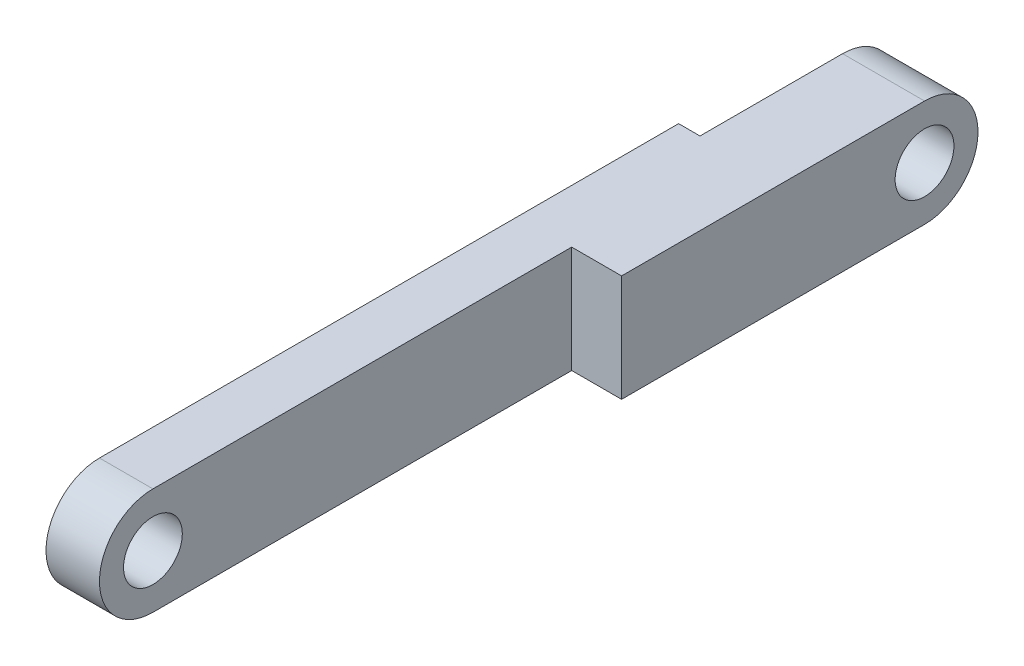
ISO-10303-21;
HEADER;
FILE_DESCRIPTION(('STEP AP214'),'2;1');
FILE_NAME('part.step','',(''),(''),'','','');
FILE_SCHEMA(('AUTOMOTIVE_DESIGN { 1 0 10303 214 1 1 1 1 }'));
ENDSEC;
DATA;
#1=APPLICATION_CONTEXT('core data for automotive mechanical design processes');
#2=APPLICATION_PROTOCOL_DEFINITION('international standard','automotive_design',2000,#1);
#3=PRODUCT_CONTEXT('',#1,'mechanical');
#4=PRODUCT('Part','Part','',(#3));
#5=PRODUCT_RELATED_PRODUCT_CATEGORY('part','',(#4));
#6=PRODUCT_DEFINITION_FORMATION('','',#4);
#7=PRODUCT_DEFINITION_CONTEXT('part definition',#1,'design');
#8=PRODUCT_DEFINITION('design','',#6,#7);
#9=PRODUCT_DEFINITION_SHAPE('','',#8);
#10=(LENGTH_UNIT() NAMED_UNIT(*) SI_UNIT(.MILLI.,.METRE.));
#11=(NAMED_UNIT(*) PLANE_ANGLE_UNIT() SI_UNIT($,.RADIAN.));
#12=(NAMED_UNIT(*) SI_UNIT($,.STERADIAN.) SOLID_ANGLE_UNIT());
#13=UNCERTAINTY_MEASURE_WITH_UNIT(LENGTH_MEASURE(1.E-05),#10,'distance_accuracy_value','');
#14=(GEOMETRIC_REPRESENTATION_CONTEXT(3) GLOBAL_UNCERTAINTY_ASSIGNED_CONTEXT((#13)) GLOBAL_UNIT_ASSIGNED_CONTEXT((#10,
#11,#12)) REPRESENTATION_CONTEXT('',''));
#15=CARTESIAN_POINT('',(0.,0.,0.));
#16=DIRECTION('',(0.,0.,1.));
#17=DIRECTION('',(1.,0.,0.));
#18=AXIS2_PLACEMENT_3D('',#15,#16,#17);
#19=CARTESIAN_POINT('',(3.,0.,0.));
#20=DIRECTION('',(1.,0.,0.));
#21=DIRECTION('',(0.,0.,-1.));
#22=AXIS2_PLACEMENT_3D('',#19,#20,#21);
#23=PLANE('',#22);
#24=DIRECTION('',(0.,-1.,0.));
#25=VECTOR('',#24,1.);
#26=CARTESIAN_POINT('',(3.,0.,-23.5));
#27=LINE('',#26,#25);
#28=CARTESIAN_POINT('',(3.,3.,-23.5));
#29=VERTEX_POINT('',#28);
#30=CARTESIAN_POINT('',(3.,-3.,-23.5));
#31=VERTEX_POINT('',#30);
#32=EDGE_CURVE('E87',#29,#31,#27,.T.);
#33=ORIENTED_EDGE('',*,*,#32,.F.);
#34=DIRECTION('',(0.,0.,1.));
#35=VECTOR('',#34,1.);
#36=CARTESIAN_POINT('',(3.,3.,0.));
#37=LINE('',#36,#35);
#38=CARTESIAN_POINT('',(3.,3.,0.));
#39=VERTEX_POINT('',#38);
#40=EDGE_CURVE('E165',#29,#39,#37,.T.);
#41=ORIENTED_EDGE('',*,*,#40,.T.);
#42=CARTESIAN_POINT('',(3.,0.,0.));
#43=DIRECTION('',(1.,0.,0.));
#44=DIRECTION('',(0.,0.,-1.));
#45=AXIS2_PLACEMENT_3D('',#42,#43,#44);
#46=CIRCLE('',#45,3.);
#47=CARTESIAN_POINT('',(3.,-3.,0.));
#48=VERTEX_POINT('',#47);
#49=EDGE_CURVE('E202',#39,#48,#46,.T.);
#50=ORIENTED_EDGE('',*,*,#49,.T.);
#51=DIRECTION('',(0.,0.,-1.));
#52=VECTOR('',#51,1.);
#53=CARTESIAN_POINT('',(3.,-3.,0.));
#54=LINE('',#53,#52);
#55=EDGE_CURVE('E206',#48,#31,#54,.T.);
#56=ORIENTED_EDGE('',*,*,#55,.T.);
#57=EDGE_LOOP('',(#33,#41,#50,#56));
#58=FACE_BOUND('',#57,.T.);
#59=CARTESIAN_POINT('',(3.,0.,0.));
#60=DIRECTION('',(1.,0.,0.));
#61=DIRECTION('',(0.,0.,-1.));
#62=AXIS2_PLACEMENT_3D('',#59,#60,#61);
#63=CIRCLE('',#62,1.65);
#64=CARTESIAN_POINT('',(3.,0.,-1.65));
#65=VERTEX_POINT('',#64);
#66=EDGE_CURVE('E194',#65,#65,#63,.T.);
#67=ORIENTED_EDGE('',*,*,#66,.F.);
#68=EDGE_LOOP('',(#67));
#69=FACE_BOUND('',#68,.T.);
#70=ADVANCED_FACE('F70',(#58,#69),#23,.T.);
#71=CARTESIAN_POINT('',(0.,0.,0.));
#72=DIRECTION('',(1.,0.,0.));
#73=DIRECTION('',(0.,0.,-1.));
#74=AXIS2_PLACEMENT_3D('',#71,#72,#73);
#75=PLANE('',#74);
#76=DIRECTION('',(0.,0.,1.));
#77=VECTOR('',#76,1.);
#78=CARTESIAN_POINT('',(0.,3.,0.));
#79=LINE('',#78,#77);
#80=CARTESIAN_POINT('',(0.,3.,-32.5));
#81=VERTEX_POINT('',#80);
#82=CARTESIAN_POINT('',(0.,3.,0.));
#83=VERTEX_POINT('',#82);
#84=EDGE_CURVE('E207',#81,#83,#79,.T.);
#85=ORIENTED_EDGE('',*,*,#84,.F.);
#86=DIRECTION('',(0.,1.,0.));
#87=VECTOR('',#86,1.);
#88=CARTESIAN_POINT('',(0.,3.,-32.5));
#89=LINE('',#88,#87);
#90=CARTESIAN_POINT('',(0.,-3.,-32.5));
#91=VERTEX_POINT('',#90);
#92=EDGE_CURVE('E167',#91,#81,#89,.T.);
#93=ORIENTED_EDGE('',*,*,#92,.F.);
#94=DIRECTION('',(0.,0.,-1.));
#95=VECTOR('',#94,1.);
#96=CARTESIAN_POINT('',(0.,-3.,0.));
#97=LINE('',#96,#95);
#98=CARTESIAN_POINT('',(0.,-3.,0.));
#99=VERTEX_POINT('',#98);
#100=EDGE_CURVE('E216',#99,#91,#97,.T.);
#101=ORIENTED_EDGE('',*,*,#100,.F.);
#102=CARTESIAN_POINT('',(0.,0.,0.));
#103=DIRECTION('',(1.,0.,0.));
#104=DIRECTION('',(0.,0.,-1.));
#105=AXIS2_PLACEMENT_3D('',#102,#103,#104);
#106=CIRCLE('',#105,3.);
#107=EDGE_CURVE('E198',#83,#99,#106,.T.);
#108=ORIENTED_EDGE('',*,*,#107,.F.);
#109=EDGE_LOOP('',(#85,#93,#101,#108));
#110=FACE_BOUND('',#109,.T.);
#111=CARTESIAN_POINT('',(0.,0.,0.));
#112=DIRECTION('',(1.,0.,0.));
#113=DIRECTION('',(0.,0.,-1.));
#114=AXIS2_PLACEMENT_3D('',#111,#112,#113);
#115=CIRCLE('',#114,1.65);
#116=CARTESIAN_POINT('',(0.,0.,-1.65));
#117=VERTEX_POINT('',#116);
#118=EDGE_CURVE('E193',#117,#117,#115,.T.);
#119=ORIENTED_EDGE('',*,*,#118,.T.);
#120=EDGE_LOOP('',(#119));
#121=FACE_BOUND('',#120,.T.);
#122=ADVANCED_FACE('F264',(#110,#121),#75,.F.);
#123=CARTESIAN_POINT('',(3.,0.,0.));
#124=DIRECTION('',(-1.,0.,0.));
#125=DIRECTION('',(0.,0.,1.));
#126=AXIS2_PLACEMENT_3D('',#123,#124,#125);
#127=CYLINDRICAL_SURFACE('',#126,3.);
#128=ORIENTED_EDGE('',*,*,#107,.T.);
#129=DIRECTION('',(-1.,0.,0.));
#130=VECTOR('',#129,1.);
#131=CARTESIAN_POINT('',(3.,-3.,0.));
#132=LINE('',#131,#130);
#133=EDGE_CURVE('E12',#48,#99,#132,.T.);
#134=ORIENTED_EDGE('',*,*,#133,.F.);
#135=ORIENTED_EDGE('',*,*,#49,.F.);
#136=DIRECTION('',(-1.,0.,0.));
#137=VECTOR('',#136,1.);
#138=CARTESIAN_POINT('',(3.,3.,0.));
#139=LINE('',#138,#137);
#140=EDGE_CURVE('E212',#39,#83,#139,.T.);
#141=ORIENTED_EDGE('',*,*,#140,.T.);
#142=EDGE_LOOP('',(#128,#134,#135,#141));
#143=FACE_BOUND('',#142,.T.);
#144=ADVANCED_FACE('F72',(#143),#127,.T.);
#145=CARTESIAN_POINT('',(3.,-3.,0.));
#146=DIRECTION('',(0.,1.,0.));
#147=DIRECTION('',(0.,0.,1.));
#148=AXIS2_PLACEMENT_3D('',#145,#146,#147);
#149=PLANE('',#148);
#150=ORIENTED_EDGE('',*,*,#100,.T.);
#151=DIRECTION('',(-1.,0.,0.));
#152=VECTOR('',#151,1.);
#153=CARTESIAN_POINT('',(1.2,-3.,-32.5));
#154=LINE('',#153,#152);
#155=CARTESIAN_POINT('',(1.2,-3.,-32.5));
#156=VERTEX_POINT('',#155);
#157=EDGE_CURVE('E182',#156,#91,#154,.T.);
#158=ORIENTED_EDGE('',*,*,#157,.F.);
#159=DIRECTION('',(0.,0.,1.));
#160=VECTOR('',#159,1.);
#161=CARTESIAN_POINT('',(1.2,-3.,-32.5));
#162=LINE('',#161,#160);
#163=CARTESIAN_POINT('',(1.2,-3.,-40.5));
#164=VERTEX_POINT('',#163);
#165=EDGE_CURVE('E171',#164,#156,#162,.T.);
#166=ORIENTED_EDGE('',*,*,#165,.F.);
#167=DIRECTION('',(-1.,0.,0.));
#168=VECTOR('',#167,1.);
#169=CARTESIAN_POINT('',(3.,-3.,-40.5));
#170=LINE('',#169,#168);
#171=CARTESIAN_POINT('',(5.8,-3.,-40.5));
#172=VERTEX_POINT('',#171);
#173=EDGE_CURVE('E80',#172,#164,#170,.T.);
#174=ORIENTED_EDGE('',*,*,#173,.F.);
#175=DIRECTION('',(0.,0.,-1.));
#176=VECTOR('',#175,1.);
#177=CARTESIAN_POINT('',(5.8,-3.,0.));
#178=LINE('',#177,#176);
#179=CARTESIAN_POINT('',(5.8,-3.,-23.5));
#180=VERTEX_POINT('',#179);
#181=EDGE_CURVE('E149',#180,#172,#178,.T.);
#182=ORIENTED_EDGE('',*,*,#181,.F.);
#183=DIRECTION('',(-1.,0.,0.));
#184=VECTOR('',#183,1.);
#185=CARTESIAN_POINT('',(5.8,-3.,-23.5));
#186=LINE('',#185,#184);
#187=EDGE_CURVE('E144',#180,#31,#186,.T.);
#188=ORIENTED_EDGE('',*,*,#187,.T.);
#189=ORIENTED_EDGE('',*,*,#55,.F.);
#190=ORIENTED_EDGE('',*,*,#133,.T.);
#191=EDGE_LOOP('',(#150,#158,#166,#174,#182,#188,#189,#190));
#192=FACE_BOUND('',#191,.T.);
#193=ADVANCED_FACE('F234',(#192),#149,.F.);
#194=CARTESIAN_POINT('',(3.,0.,-40.5));
#195=DIRECTION('',(-1.,0.,0.));
#196=DIRECTION('',(0.,0.,1.));
#197=AXIS2_PLACEMENT_3D('',#194,#195,#196);
#198=CYLINDRICAL_SURFACE('',#197,3.);
#199=CARTESIAN_POINT('',(1.2,0.,-40.5));
#200=DIRECTION('',(1.,0.,0.));
#201=DIRECTION('',(0.,0.,-1.));
#202=AXIS2_PLACEMENT_3D('',#199,#200,#201);
#203=CIRCLE('',#202,3.);
#204=CARTESIAN_POINT('',(1.2,3.,-40.5));
#205=VERTEX_POINT('',#204);
#206=EDGE_CURVE('E190',#164,#205,#203,.T.);
#207=ORIENTED_EDGE('',*,*,#206,.T.);
#208=DIRECTION('',(-1.,0.,0.));
#209=VECTOR('',#208,1.);
#210=CARTESIAN_POINT('',(3.,3.,-40.5));
#211=LINE('',#210,#209);
#212=CARTESIAN_POINT('',(5.8,3.,-40.5));
#213=VERTEX_POINT('',#212);
#214=EDGE_CURVE('E225',#213,#205,#211,.T.);
#215=ORIENTED_EDGE('',*,*,#214,.F.);
#216=CARTESIAN_POINT('',(5.8,0.,-40.5));
#217=DIRECTION('',(1.,0.,0.));
#218=DIRECTION('',(0.,0.,-1.));
#219=AXIS2_PLACEMENT_3D('',#216,#217,#218);
#220=CIRCLE('',#219,3.);
#221=EDGE_CURVE('E156',#172,#213,#220,.T.);
#222=ORIENTED_EDGE('',*,*,#221,.F.);
#223=ORIENTED_EDGE('',*,*,#173,.T.);
#224=EDGE_LOOP('',(#207,#215,#222,#223));
#225=FACE_BOUND('',#224,.T.);
#226=ADVANCED_FACE('F231',(#225),#198,.T.);
#227=CARTESIAN_POINT('',(3.,3.,0.));
#228=DIRECTION('',(0.,-1.,0.));
#229=DIRECTION('',(0.,0.,-1.));
#230=AXIS2_PLACEMENT_3D('',#227,#228,#229);
#231=PLANE('',#230);
#232=DIRECTION('',(0.,0.,-1.));
#233=VECTOR('',#232,1.);
#234=CARTESIAN_POINT('',(1.2,3.,-43.5));
#235=LINE('',#234,#233);
#236=CARTESIAN_POINT('',(1.2,3.,-32.5));
#237=VERTEX_POINT('',#236);
#238=EDGE_CURVE('E180',#237,#205,#235,.T.);
#239=ORIENTED_EDGE('',*,*,#238,.F.);
#240=DIRECTION('',(-1.,0.,0.));
#241=VECTOR('',#240,1.);
#242=CARTESIAN_POINT('',(1.2,3.,-32.5));
#243=LINE('',#242,#241);
#244=EDGE_CURVE('E184',#237,#81,#243,.T.);
#245=ORIENTED_EDGE('',*,*,#244,.T.);
#246=ORIENTED_EDGE('',*,*,#84,.T.);
#247=ORIENTED_EDGE('',*,*,#140,.F.);
#248=ORIENTED_EDGE('',*,*,#40,.F.);
#249=DIRECTION('',(-1.,0.,0.));
#250=VECTOR('',#249,1.);
#251=CARTESIAN_POINT('',(5.8,3.,-23.5));
#252=LINE('',#251,#250);
#253=CARTESIAN_POINT('',(5.8,3.,-23.5));
#254=VERTEX_POINT('',#253);
#255=EDGE_CURVE('E142',#254,#29,#252,.T.);
#256=ORIENTED_EDGE('',*,*,#255,.F.);
#257=DIRECTION('',(0.,0.,1.));
#258=VECTOR('',#257,1.);
#259=CARTESIAN_POINT('',(5.8,3.,0.));
#260=LINE('',#259,#258);
#261=EDGE_CURVE('E150',#213,#254,#260,.T.);
#262=ORIENTED_EDGE('',*,*,#261,.F.);
#263=ORIENTED_EDGE('',*,*,#214,.T.);
#264=EDGE_LOOP('',(#239,#245,#246,#247,#248,#256,#262,#263));
#265=FACE_BOUND('',#264,.T.);
#266=ADVANCED_FACE('F163',(#265),#231,.F.);
#267=CARTESIAN_POINT('',(3.,0.,-40.5));
#268=DIRECTION('',(-1.,0.,0.));
#269=DIRECTION('',(0.,0.,1.));
#270=AXIS2_PLACEMENT_3D('',#267,#268,#269);
#271=CYLINDRICAL_SURFACE('',#270,1.65);
#272=CARTESIAN_POINT('',(1.2,0.,-40.5));
#273=DIRECTION('',(1.,0.,0.));
#274=DIRECTION('',(0.,0.,-1.));
#275=AXIS2_PLACEMENT_3D('',#272,#273,#274);
#276=CIRCLE('',#275,1.65);
#277=CARTESIAN_POINT('',(1.2,0.,-42.15));
#278=VERTEX_POINT('',#277);
#279=EDGE_CURVE('E74',#278,#278,#276,.T.);
#280=ORIENTED_EDGE('',*,*,#279,.F.);
#281=EDGE_LOOP('',(#280));
#282=FACE_BOUND('',#281,.T.);
#283=CARTESIAN_POINT('',(5.8,0.,-40.5));
#284=DIRECTION('',(1.,0.,0.));
#285=DIRECTION('',(0.,0.,-1.));
#286=AXIS2_PLACEMENT_3D('',#283,#284,#285);
#287=CIRCLE('',#286,1.65);
#288=CARTESIAN_POINT('',(5.8,0.,-42.15));
#289=VERTEX_POINT('',#288);
#290=EDGE_CURVE('E160',#289,#289,#287,.F.);
#291=ORIENTED_EDGE('',*,*,#290,.F.);
#292=EDGE_LOOP('',(#291));
#293=FACE_BOUND('',#292,.T.);
#294=ADVANCED_FACE('F247',(#282,#293),#271,.F.);
#295=CARTESIAN_POINT('',(3.,0.,0.));
#296=DIRECTION('',(-1.,0.,0.));
#297=DIRECTION('',(0.,0.,1.));
#298=AXIS2_PLACEMENT_3D('',#295,#296,#297);
#299=CYLINDRICAL_SURFACE('',#298,1.65);
#300=ORIENTED_EDGE('',*,*,#66,.T.);
#301=EDGE_LOOP('',(#300));
#302=FACE_BOUND('',#301,.T.);
#303=ORIENTED_EDGE('',*,*,#118,.F.);
#304=EDGE_LOOP('',(#303));
#305=FACE_BOUND('',#304,.T.);
#306=ADVANCED_FACE('F249',(#302,#305),#299,.F.);
#307=CARTESIAN_POINT('',(1.2,0.,0.));
#308=DIRECTION('',(1.,0.,0.));
#309=DIRECTION('',(0.,0.,-1.));
#310=AXIS2_PLACEMENT_3D('',#307,#308,#309);
#311=PLANE('',#310);
#312=ORIENTED_EDGE('',*,*,#279,.T.);
#313=EDGE_LOOP('',(#312));
#314=FACE_BOUND('',#313,.T.);
#315=ORIENTED_EDGE('',*,*,#206,.F.);
#316=ORIENTED_EDGE('',*,*,#165,.T.);
#317=DIRECTION('',(0.,1.,0.));
#318=VECTOR('',#317,1.);
#319=CARTESIAN_POINT('',(1.2,3.,-32.5));
#320=LINE('',#319,#318);
#321=EDGE_CURVE('E95',#156,#237,#320,.T.);
#322=ORIENTED_EDGE('',*,*,#321,.T.);
#323=ORIENTED_EDGE('',*,*,#238,.T.);
#324=EDGE_LOOP('',(#315,#316,#322,#323));
#325=FACE_BOUND('',#324,.T.);
#326=ADVANCED_FACE('F257',(#314,#325),#311,.F.);
#327=CARTESIAN_POINT('',(1.2,3.,-32.5));
#328=DIRECTION('',(0.,0.,1.));
#329=DIRECTION('',(1.,0.,0.));
#330=AXIS2_PLACEMENT_3D('',#327,#328,#329);
#331=PLANE('',#330);
#332=ORIENTED_EDGE('',*,*,#92,.T.);
#333=ORIENTED_EDGE('',*,*,#244,.F.);
#334=ORIENTED_EDGE('',*,*,#321,.F.);
#335=ORIENTED_EDGE('',*,*,#157,.T.);
#336=EDGE_LOOP('',(#332,#333,#334,#335));
#337=FACE_BOUND('',#336,.T.);
#338=ADVANCED_FACE('F288',(#337),#331,.F.);
#339=CARTESIAN_POINT('',(5.8,0.,-23.5));
#340=DIRECTION('',(0.,0.,-1.));
#341=DIRECTION('',(-1.,0.,0.));
#342=AXIS2_PLACEMENT_3D('',#339,#340,#341);
#343=PLANE('',#342);
#344=ORIENTED_EDGE('',*,*,#32,.T.);
#345=ORIENTED_EDGE('',*,*,#187,.F.);
#346=DIRECTION('',(0.,-1.,0.));
#347=VECTOR('',#346,1.);
#348=CARTESIAN_POINT('',(5.8,0.,-23.5));
#349=LINE('',#348,#347);
#350=EDGE_CURVE('E138',#254,#180,#349,.T.);
#351=ORIENTED_EDGE('',*,*,#350,.F.);
#352=ORIENTED_EDGE('',*,*,#255,.T.);
#353=EDGE_LOOP('',(#344,#345,#351,#352));
#354=FACE_BOUND('',#353,.T.);
#355=ADVANCED_FACE('F140',(#354),#343,.F.);
#356=CARTESIAN_POINT('',(5.8,0.,0.));
#357=DIRECTION('',(1.,0.,0.));
#358=DIRECTION('',(0.,0.,-1.));
#359=AXIS2_PLACEMENT_3D('',#356,#357,#358);
#360=PLANE('',#359);
#361=ORIENTED_EDGE('',*,*,#290,.T.);
#362=EDGE_LOOP('',(#361));
#363=FACE_BOUND('',#362,.T.);
#364=ORIENTED_EDGE('',*,*,#261,.T.);
#365=ORIENTED_EDGE('',*,*,#350,.T.);
#366=ORIENTED_EDGE('',*,*,#181,.T.);
#367=ORIENTED_EDGE('',*,*,#221,.T.);
#368=EDGE_LOOP('',(#364,#365,#366,#367));
#369=FACE_BOUND('',#368,.T.);
#370=ADVANCED_FACE('F154',(#363,#369),#360,.T.);
#371=CLOSED_SHELL('',(#70,#122,#144,#193,#226,#266,#294,#306,#326,#338,#355,#370));
#372=MANIFOLD_SOLID_BREP('B2',#371);
#373=ADVANCED_BREP_SHAPE_REPRESENTATION('',(#18,#372),#14);
#374=SHAPE_DEFINITION_REPRESENTATION(#9,#373);
ENDSEC;
END-ISO-10303-21;
